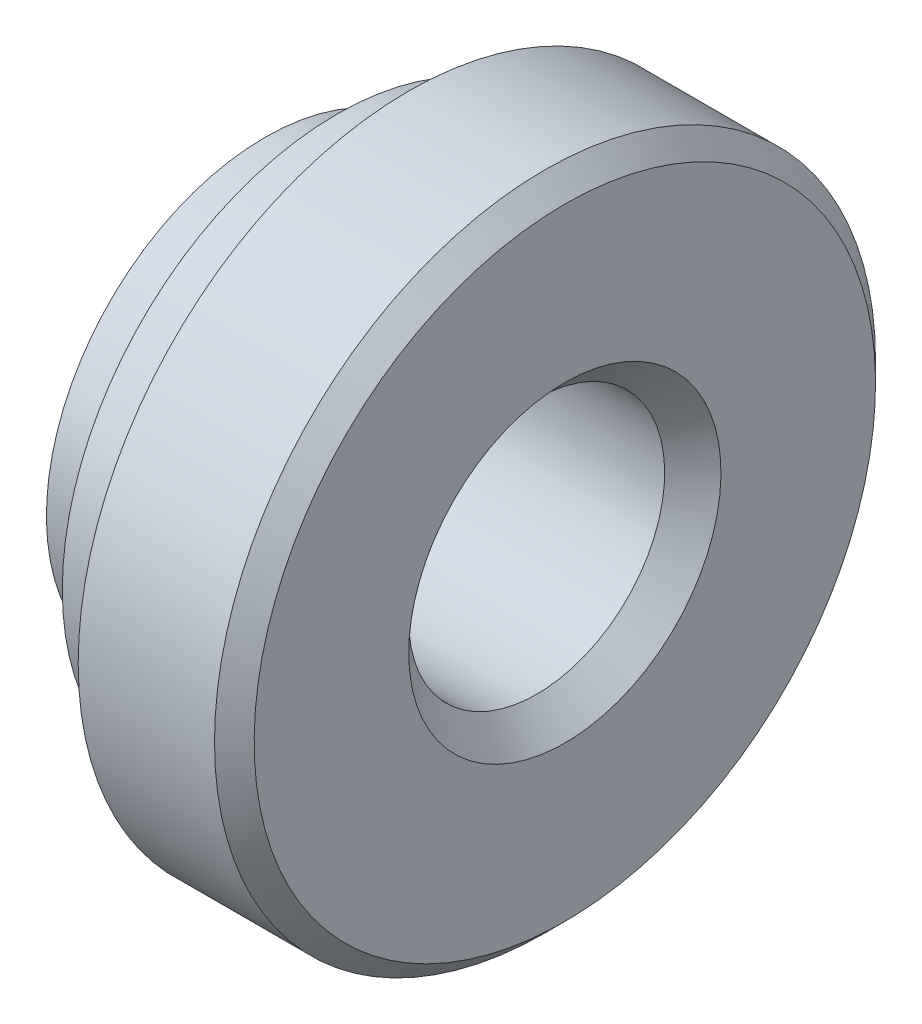
ISO-10303-21;
HEADER;
FILE_DESCRIPTION(('STEP AP214'),'2;1');
FILE_NAME('part.step','',(''),(''),'','','');
FILE_SCHEMA(('AUTOMOTIVE_DESIGN { 1 0 10303 214 1 1 1 1 }'));
ENDSEC;
DATA;
#1=APPLICATION_CONTEXT('core data for automotive mechanical design processes');
#2=APPLICATION_PROTOCOL_DEFINITION('international standard','automotive_design',2000,#1);
#3=PRODUCT_CONTEXT('',#1,'mechanical');
#4=PRODUCT('Part','Part','',(#3));
#5=PRODUCT_RELATED_PRODUCT_CATEGORY('part','',(#4));
#6=PRODUCT_DEFINITION_FORMATION('','',#4);
#7=PRODUCT_DEFINITION_CONTEXT('part definition',#1,'design');
#8=PRODUCT_DEFINITION('design','',#6,#7);
#9=PRODUCT_DEFINITION_SHAPE('','',#8);
#10=(LENGTH_UNIT() NAMED_UNIT(*) SI_UNIT(.MILLI.,.METRE.));
#11=(NAMED_UNIT(*) PLANE_ANGLE_UNIT() SI_UNIT($,.RADIAN.));
#12=(NAMED_UNIT(*) SI_UNIT($,.STERADIAN.) SOLID_ANGLE_UNIT());
#13=UNCERTAINTY_MEASURE_WITH_UNIT(LENGTH_MEASURE(1.E-05),#10,'distance_accuracy_value','');
#14=(GEOMETRIC_REPRESENTATION_CONTEXT(3) GLOBAL_UNCERTAINTY_ASSIGNED_CONTEXT((#13)) GLOBAL_UNIT_ASSIGNED_CONTEXT((#10,
#11,#12)) REPRESENTATION_CONTEXT('',''));
#15=CARTESIAN_POINT('',(0.,0.,0.));
#16=DIRECTION('',(0.,0.,1.));
#17=DIRECTION('',(1.,0.,0.));
#18=AXIS2_PLACEMENT_3D('',#15,#16,#17);
#19=CARTESIAN_POINT('',(0.690000000020063,2.6375,0.));
#20=DIRECTION('',(-1.,0.,0.));
#21=DIRECTION('',(0.,-1.,0.));
#22=AXIS2_PLACEMENT_3D('',#19,#20,#21);
#23=PLANE('',#22);
#24=CARTESIAN_POINT('',(0.690000000020063,0.,0.));
#25=DIRECTION('',(1.,0.,0.));
#26=DIRECTION('',(0.,1.,0.));
#27=AXIS2_PLACEMENT_3D('',#24,#25,#26);
#28=CIRCLE('',#27,2.06499999999641);
#29=CARTESIAN_POINT('',(0.690000000020063,2.06499999999641,0.));
#30=VERTEX_POINT('',#29);
#31=EDGE_CURVE('E73',#30,#30,#28,.T.);
#32=ORIENTED_EDGE('',*,*,#31,.T.);
#33=EDGE_LOOP('',(#32));
#34=FACE_BOUND('',#33,.T.);
#35=CARTESIAN_POINT('',(0.690000000020063,0.,0.));
#36=DIRECTION('',(1.,0.,0.));
#37=DIRECTION('',(0.,1.,0.));
#38=AXIS2_PLACEMENT_3D('',#35,#36,#37);
#39=CIRCLE('',#38,2.6375);
#40=CARTESIAN_POINT('',(0.690000000020063,2.6375,0.));
#41=VERTEX_POINT('',#40);
#42=EDGE_CURVE('E10',#41,#41,#39,.T.);
#43=ORIENTED_EDGE('',*,*,#42,.F.);
#44=EDGE_LOOP('',(#43));
#45=FACE_BOUND('',#44,.T.);
#46=ADVANCED_FACE('F33',(#34,#45),#23,.T.);
#47=CARTESIAN_POINT('',(0.,0.,0.));
#48=DIRECTION('',(1.,0.,0.));
#49=DIRECTION('',(0.,1.,0.));
#50=AXIS2_PLACEMENT_3D('',#47,#48,#49);
#51=CYLINDRICAL_SURFACE('',#50,2.6375);
#52=ORIENTED_EDGE('',*,*,#42,.T.);
#53=EDGE_LOOP('',(#52));
#54=FACE_BOUND('',#53,.T.);
#55=CARTESIAN_POINT('',(1.38000000002006,0.,0.));
#56=DIRECTION('',(1.,0.,0.));
#57=DIRECTION('',(0.,1.,0.));
#58=AXIS2_PLACEMENT_3D('',#55,#56,#57);
#59=CIRCLE('',#58,2.6375);
#60=CARTESIAN_POINT('',(1.38000000002006,2.6375,0.));
#61=VERTEX_POINT('',#60);
#62=EDGE_CURVE('E39',#61,#61,#59,.T.);
#63=ORIENTED_EDGE('',*,*,#62,.F.);
#64=EDGE_LOOP('',(#63));
#65=FACE_BOUND('',#64,.T.);
#66=ADVANCED_FACE('F91',(#54,#65),#51,.T.);
#67=CARTESIAN_POINT('',(1.38000000002006,3.17499999989971,0.));
#68=DIRECTION('',(-1.,0.,0.));
#69=DIRECTION('',(0.,-1.,0.));
#70=AXIS2_PLACEMENT_3D('',#67,#68,#69);
#71=PLANE('',#70);
#72=ORIENTED_EDGE('',*,*,#62,.T.);
#73=EDGE_LOOP('',(#72));
#74=FACE_BOUND('',#73,.T.);
#75=CARTESIAN_POINT('',(1.38000000002006,0.,0.));
#76=DIRECTION('',(1.,0.,0.));
#77=DIRECTION('',(0.,1.,0.));
#78=AXIS2_PLACEMENT_3D('',#75,#76,#77);
#79=CIRCLE('',#78,3.17499999989971);
#80=CARTESIAN_POINT('',(1.38000000002006,3.17499999989971,0.));
#81=VERTEX_POINT('',#80);
#82=EDGE_CURVE('E43',#81,#81,#79,.T.);
#83=ORIENTED_EDGE('',*,*,#82,.F.);
#84=EDGE_LOOP('',(#83));
#85=FACE_BOUND('',#84,.T.);
#86=ADVANCED_FACE('F95',(#74,#85),#71,.T.);
#87=CARTESIAN_POINT('',(0.,0.,0.));
#88=DIRECTION('',(1.,0.,0.));
#89=DIRECTION('',(0.,1.,0.));
#90=AXIS2_PLACEMENT_3D('',#87,#88,#89);
#91=CYLINDRICAL_SURFACE('',#90,3.17499999989971);
#92=ORIENTED_EDGE('',*,*,#82,.T.);
#93=EDGE_LOOP('',(#92));
#94=FACE_BOUND('',#93,.T.);
#95=CARTESIAN_POINT('',(2.68950000012916,0.,0.));
#96=DIRECTION('',(1.,0.,0.));
#97=DIRECTION('',(0.,1.,0.));
#98=AXIS2_PLACEMENT_3D('',#95,#96,#97);
#99=CIRCLE('',#98,3.17499999989971);
#100=CARTESIAN_POINT('',(2.68950000012916,3.17499999989971,0.));
#101=VERTEX_POINT('',#100);
#102=EDGE_CURVE('E47',#101,#101,#99,.T.);
#103=ORIENTED_EDGE('',*,*,#102,.F.);
#104=EDGE_LOOP('',(#103));
#105=FACE_BOUND('',#104,.T.);
#106=ADVANCED_FACE('F99',(#94,#105),#91,.T.);
#107=CARTESIAN_POINT('',(2.88000000010061,0.,0.));
#108=DIRECTION('',(-1.,0.,0.));
#109=DIRECTION('',(0.,-1.,0.));
#110=AXIS2_PLACEMENT_3D('',#107,#108,#109);
#111=CONICAL_SURFACE('',#110,2.98449999992826,0.785398163397448);
#112=ORIENTED_EDGE('',*,*,#102,.T.);
#113=EDGE_LOOP('',(#112));
#114=FACE_BOUND('',#113,.T.);
#115=CARTESIAN_POINT('',(2.88000000010061,0.,0.));
#116=DIRECTION('',(1.,0.,0.));
#117=DIRECTION('',(0.,1.,0.));
#118=AXIS2_PLACEMENT_3D('',#115,#116,#117);
#119=CIRCLE('',#118,2.98449999992826);
#120=CARTESIAN_POINT('',(2.88000000010061,2.98449999992826,0.));
#121=VERTEX_POINT('',#120);
#122=EDGE_CURVE('E52',#121,#121,#119,.T.);
#123=ORIENTED_EDGE('',*,*,#122,.F.);
#124=EDGE_LOOP('',(#123));
#125=FACE_BOUND('',#124,.T.);
#126=ADVANCED_FACE('F105',(#114,#125),#111,.T.);
#127=CARTESIAN_POINT('',(2.88000000010061,1.50000000003828,0.));
#128=DIRECTION('',(1.,0.,0.));
#129=DIRECTION('',(0.,1.,0.));
#130=AXIS2_PLACEMENT_3D('',#127,#128,#129);
#131=PLANE('',#130);
#132=ORIENTED_EDGE('',*,*,#122,.T.);
#133=EDGE_LOOP('',(#132));
#134=FACE_BOUND('',#133,.T.);
#135=CARTESIAN_POINT('',(2.88000000010061,0.,0.));
#136=DIRECTION('',(1.,0.,0.));
#137=DIRECTION('',(0.,1.,0.));
#138=AXIS2_PLACEMENT_3D('',#135,#136,#137);
#139=CIRCLE('',#138,1.50000000003828);
#140=CARTESIAN_POINT('',(2.88000000010061,1.50000000003828,0.));
#141=VERTEX_POINT('',#140);
#142=EDGE_CURVE('E55',#141,#141,#139,.T.);
#143=ORIENTED_EDGE('',*,*,#142,.F.);
#144=EDGE_LOOP('',(#143));
#145=FACE_BOUND('',#144,.T.);
#146=ADVANCED_FACE('F109',(#134,#145),#131,.T.);
#147=CARTESIAN_POINT('',(2.60950000007301,0.,0.));
#148=DIRECTION('',(1.,0.,0.));
#149=DIRECTION('',(0.,1.,0.));
#150=AXIS2_PLACEMENT_3D('',#147,#148,#149);
#151=CONICAL_SURFACE('',#150,1.22950000001069,0.785398163397448);
#152=ORIENTED_EDGE('',*,*,#142,.T.);
#153=EDGE_LOOP('',(#152));
#154=FACE_BOUND('',#153,.T.);
#155=CARTESIAN_POINT('',(2.60950000007301,0.,0.));
#156=DIRECTION('',(1.,0.,0.));
#157=DIRECTION('',(0.,1.,0.));
#158=AXIS2_PLACEMENT_3D('',#155,#156,#157);
#159=CIRCLE('',#158,1.22950000001069);
#160=CARTESIAN_POINT('',(2.60950000007301,1.22950000001069,0.));
#161=VERTEX_POINT('',#160);
#162=EDGE_CURVE('E58',#161,#161,#159,.T.);
#163=ORIENTED_EDGE('',*,*,#162,.F.);
#164=EDGE_LOOP('',(#163));
#165=FACE_BOUND('',#164,.T.);
#166=ADVANCED_FACE('F113',(#154,#165),#151,.F.);
#167=CARTESIAN_POINT('',(0.,0.,0.));
#168=DIRECTION('',(1.,0.,0.));
#169=DIRECTION('',(0.,1.,0.));
#170=AXIS2_PLACEMENT_3D('',#167,#168,#169);
#171=CYLINDRICAL_SURFACE('',#170,1.22950000001069);
#172=ORIENTED_EDGE('',*,*,#162,.T.);
#173=EDGE_LOOP('',(#172));
#174=FACE_BOUND('',#173,.T.);
#175=CARTESIAN_POINT('',(0.270500000010686,0.,0.));
#176=DIRECTION('',(1.,0.,0.));
#177=DIRECTION('',(0.,1.,0.));
#178=AXIS2_PLACEMENT_3D('',#175,#176,#177);
#179=CIRCLE('',#178,1.22950000001069);
#180=CARTESIAN_POINT('',(0.270500000010686,1.22950000001069,0.));
#181=VERTEX_POINT('',#180);
#182=EDGE_CURVE('E61',#181,#181,#179,.T.);
#183=ORIENTED_EDGE('',*,*,#182,.F.);
#184=EDGE_LOOP('',(#183));
#185=FACE_BOUND('',#184,.T.);
#186=ADVANCED_FACE('F117',(#174,#185),#171,.F.);
#187=CARTESIAN_POINT('',(0.,0.,0.));
#188=DIRECTION('',(-1.,0.,0.));
#189=DIRECTION('',(0.,-1.,0.));
#190=AXIS2_PLACEMENT_3D('',#187,#188,#189);
#191=CONICAL_SURFACE('',#190,1.50000000002137,0.785398163397448);
#192=ORIENTED_EDGE('',*,*,#182,.T.);
#193=EDGE_LOOP('',(#192));
#194=FACE_BOUND('',#193,.T.);
#195=CARTESIAN_POINT('',(0.,0.,0.));
#196=DIRECTION('',(1.,0.,0.));
#197=DIRECTION('',(0.,1.,0.));
#198=AXIS2_PLACEMENT_3D('',#195,#196,#197);
#199=CIRCLE('',#198,1.50000000002137);
#200=CARTESIAN_POINT('',(0.,1.50000000002137,0.));
#201=VERTEX_POINT('',#200);
#202=EDGE_CURVE('E64',#201,#201,#199,.T.);
#203=ORIENTED_EDGE('',*,*,#202,.F.);
#204=EDGE_LOOP('',(#203));
#205=FACE_BOUND('',#204,.T.);
#206=ADVANCED_FACE('F121',(#194,#205),#191,.F.);
#207=CARTESIAN_POINT('',(0.,2.1,0.));
#208=DIRECTION('',(-1.,0.,0.));
#209=DIRECTION('',(0.,-1.,0.));
#210=AXIS2_PLACEMENT_3D('',#207,#208,#209);
#211=PLANE('',#210);
#212=ORIENTED_EDGE('',*,*,#202,.T.);
#213=EDGE_LOOP('',(#212));
#214=FACE_BOUND('',#213,.T.);
#215=CARTESIAN_POINT('',(0.,0.,0.));
#216=DIRECTION('',(1.,0.,0.));
#217=DIRECTION('',(0.,1.,0.));
#218=AXIS2_PLACEMENT_3D('',#215,#216,#217);
#219=CIRCLE('',#218,2.1);
#220=CARTESIAN_POINT('',(0.,2.1,0.));
#221=VERTEX_POINT('',#220);
#222=EDGE_CURVE('E67',#221,#221,#219,.T.);
#223=ORIENTED_EDGE('',*,*,#222,.F.);
#224=EDGE_LOOP('',(#223));
#225=FACE_BOUND('',#224,.T.);
#226=ADVANCED_FACE('F87',(#214,#225),#211,.T.);
#227=CARTESIAN_POINT('',(0.,0.,0.));
#228=DIRECTION('',(1.,0.,0.));
#229=DIRECTION('',(0.,1.,0.));
#230=AXIS2_PLACEMENT_3D('',#227,#228,#229);
#231=CYLINDRICAL_SURFACE('',#230,2.1);
#232=ORIENTED_EDGE('',*,*,#222,.T.);
#233=EDGE_LOOP('',(#232));
#234=FACE_BOUND('',#233,.T.);
#235=CARTESIAN_POINT('',(0.318461538461539,0.,0.));
#236=DIRECTION('',(1.,0.,0.));
#237=DIRECTION('',(0.,1.,0.));
#238=AXIS2_PLACEMENT_3D('',#235,#236,#237);
#239=CIRCLE('',#238,2.1);
#240=CARTESIAN_POINT('',(0.318461538461539,2.1,0.));
#241=VERTEX_POINT('',#240);
#242=EDGE_CURVE('E70',#241,#241,#239,.T.);
#243=ORIENTED_EDGE('',*,*,#242,.F.);
#244=EDGE_LOOP('',(#243));
#245=FACE_BOUND('',#244,.T.);
#246=ADVANCED_FACE('F81',(#234,#245),#231,.T.);
#247=CARTESIAN_POINT('',(0.690000000020063,0.,0.));
#248=DIRECTION('',(-1.,0.,0.));
#249=DIRECTION('',(0.,-1.,0.));
#250=AXIS2_PLACEMENT_3D('',#247,#248,#249);
#251=CONICAL_SURFACE('',#250,2.06499999999641,0.0939257149152459);
#252=ORIENTED_EDGE('',*,*,#242,.T.);
#253=EDGE_LOOP('',(#252));
#254=FACE_BOUND('',#253,.T.);
#255=ORIENTED_EDGE('',*,*,#31,.F.);
#256=EDGE_LOOP('',(#255));
#257=FACE_BOUND('',#256,.T.);
#258=ADVANCED_FACE('F79',(#254,#257),#251,.T.);
#259=CLOSED_SHELL('',(#46,#66,#86,#106,#126,#146,#166,#186,#206,#226,#246,#258));
#260=MANIFOLD_SOLID_BREP('B2',#259);
#261=ADVANCED_BREP_SHAPE_REPRESENTATION('',(#18,#260),#14);
#262=SHAPE_DEFINITION_REPRESENTATION(#9,#261);
ENDSEC;
END-ISO-10303-21;
